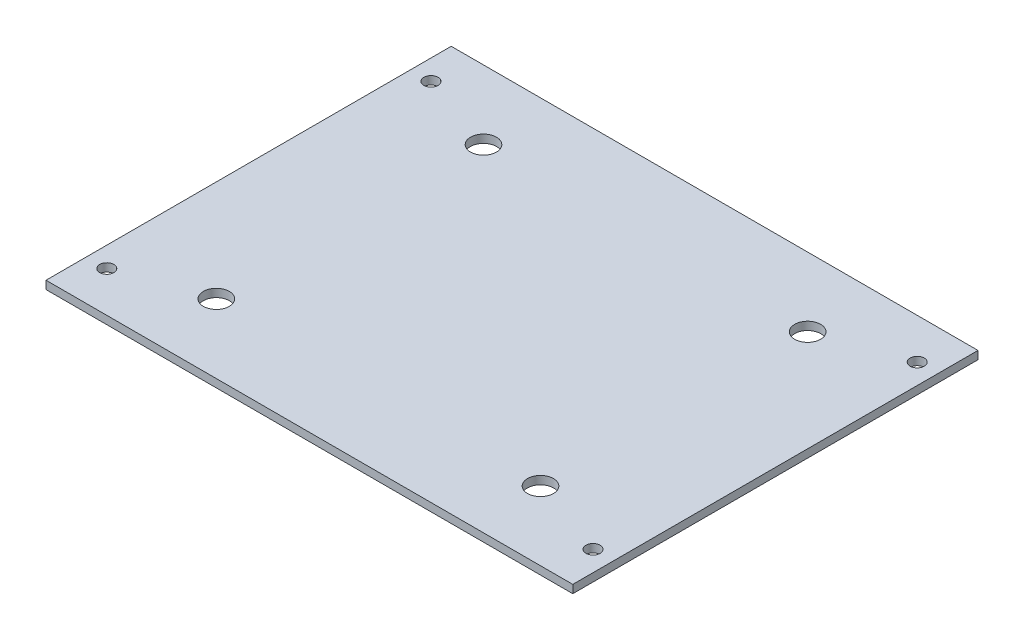
ISO-10303-21;
HEADER;
FILE_DESCRIPTION(('STEP AP214'),'2;1');
FILE_NAME('part.step','',(''),(''),'','','');
FILE_SCHEMA(('AUTOMOTIVE_DESIGN { 1 0 10303 214 1 1 1 1 }'));
ENDSEC;
DATA;
#1=APPLICATION_CONTEXT('core data for automotive mechanical design processes');
#2=APPLICATION_PROTOCOL_DEFINITION('international standard','automotive_design',2000,#1);
#3=PRODUCT_CONTEXT('',#1,'mechanical');
#4=PRODUCT('Part','Part','',(#3));
#5=PRODUCT_RELATED_PRODUCT_CATEGORY('part','',(#4));
#6=PRODUCT_DEFINITION_FORMATION('','',#4);
#7=PRODUCT_DEFINITION_CONTEXT('part definition',#1,'design');
#8=PRODUCT_DEFINITION('design','',#6,#7);
#9=PRODUCT_DEFINITION_SHAPE('','',#8);
#10=(LENGTH_UNIT() NAMED_UNIT(*) SI_UNIT(.MILLI.,.METRE.));
#11=(NAMED_UNIT(*) PLANE_ANGLE_UNIT() SI_UNIT($,.RADIAN.));
#12=(NAMED_UNIT(*) SI_UNIT($,.STERADIAN.) SOLID_ANGLE_UNIT());
#13=UNCERTAINTY_MEASURE_WITH_UNIT(LENGTH_MEASURE(1.E-05),#10,'distance_accuracy_value','');
#14=(GEOMETRIC_REPRESENTATION_CONTEXT(3) GLOBAL_UNCERTAINTY_ASSIGNED_CONTEXT((#13)) GLOBAL_UNIT_ASSIGNED_CONTEXT((#10,
#11,#12)) REPRESENTATION_CONTEXT('',''));
#15=CARTESIAN_POINT('',(0.,0.,0.));
#16=DIRECTION('',(0.,0.,1.));
#17=DIRECTION('',(1.,0.,0.));
#18=AXIS2_PLACEMENT_3D('',#15,#16,#17);
#19=CARTESIAN_POINT('',(0.,2.,0.));
#20=DIRECTION('',(0.,-1.,0.));
#21=DIRECTION('',(0.,0.,-1.));
#22=AXIS2_PLACEMENT_3D('',#19,#20,#21);
#23=PLANE('',#22);
#24=DIRECTION('',(0.,0.,1.));
#25=VECTOR('',#24,1.);
#26=CARTESIAN_POINT('',(0.,2.,0.));
#27=LINE('',#26,#25);
#28=CARTESIAN_POINT('',(0.,2.,-100.));
#29=VERTEX_POINT('',#28);
#30=CARTESIAN_POINT('',(0.,2.,0.));
#31=VERTEX_POINT('',#30);
#32=EDGE_CURVE('E84',#29,#31,#27,.T.);
#33=ORIENTED_EDGE('',*,*,#32,.T.);
#34=DIRECTION('',(1.,0.,0.));
#35=VECTOR('',#34,1.);
#36=CARTESIAN_POINT('',(0.,2.,0.));
#37=LINE('',#36,#35);
#38=CARTESIAN_POINT('',(130.,2.,0.));
#39=VERTEX_POINT('',#38);
#40=EDGE_CURVE('E79',#31,#39,#37,.T.);
#41=ORIENTED_EDGE('',*,*,#40,.T.);
#42=DIRECTION('',(0.,0.,-1.));
#43=VECTOR('',#42,1.);
#44=CARTESIAN_POINT('',(130.,2.,0.));
#45=LINE('',#44,#43);
#46=CARTESIAN_POINT('',(130.,2.,-100.));
#47=VERTEX_POINT('',#46);
#48=EDGE_CURVE('E82',#39,#47,#45,.T.);
#49=ORIENTED_EDGE('',*,*,#48,.T.);
#50=DIRECTION('',(-1.,0.,0.));
#51=VECTOR('',#50,1.);
#52=CARTESIAN_POINT('',(0.,2.,-100.));
#53=LINE('',#52,#51);
#54=EDGE_CURVE('E49',#47,#29,#53,.T.);
#55=ORIENTED_EDGE('',*,*,#54,.T.);
#56=EDGE_LOOP('',(#33,#41,#49,#55));
#57=FACE_BOUND('',#56,.T.);
#58=CARTESIAN_POINT('',(105.,1.99999999999945,-17.0342478014983));
#59=DIRECTION('',(0.,1.,0.));
#60=DIRECTION('',(0.,0.,1.));
#61=AXIS2_PLACEMENT_3D('',#58,#59,#60);
#62=CIRCLE('',#61,3.20000000000001);
#63=CARTESIAN_POINT('',(105.,1.99999999999945,-13.8342478014983));
#64=VERTEX_POINT('',#63);
#65=EDGE_CURVE('E99',#64,#64,#62,.T.);
#66=ORIENTED_EDGE('',*,*,#65,.F.);
#67=EDGE_LOOP('',(#66));
#68=FACE_BOUND('',#67,.T.);
#69=CARTESIAN_POINT('',(24.9999999999998,1.99999999999945,-17.0342478014983));
#70=DIRECTION('',(0.,1.,0.));
#71=DIRECTION('',(0.,0.,1.));
#72=AXIS2_PLACEMENT_3D('',#69,#70,#71);
#73=CIRCLE('',#72,3.19999999999999);
#74=CARTESIAN_POINT('',(24.9999999999998,1.99999999999945,-13.8342478014983));
#75=VERTEX_POINT('',#74);
#76=EDGE_CURVE('E114',#75,#75,#73,.T.);
#77=ORIENTED_EDGE('',*,*,#76,.F.);
#78=EDGE_LOOP('',(#77));
#79=FACE_BOUND('',#78,.T.);
#80=CARTESIAN_POINT('',(105.,1.99999999999942,-82.9657521985017));
#81=DIRECTION('',(0.,1.,0.));
#82=DIRECTION('',(0.,0.,-1.));
#83=AXIS2_PLACEMENT_3D('',#80,#81,#82);
#84=CIRCLE('',#83,3.20000000000001);
#85=CARTESIAN_POINT('',(105.,1.99999999999942,-86.1657521985017));
#86=VERTEX_POINT('',#85);
#87=EDGE_CURVE('E120',#86,#86,#84,.T.);
#88=ORIENTED_EDGE('',*,*,#87,.F.);
#89=EDGE_LOOP('',(#88));
#90=FACE_BOUND('',#89,.T.);
#91=CARTESIAN_POINT('',(24.9999999999998,1.99999999999942,-82.9657521985017));
#92=DIRECTION('',(0.,1.,0.));
#93=DIRECTION('',(0.,0.,-1.));
#94=AXIS2_PLACEMENT_3D('',#91,#92,#93);
#95=CIRCLE('',#94,3.19999999999999);
#96=CARTESIAN_POINT('',(24.9999999999998,1.99999999999942,-86.1657521985017));
#97=VERTEX_POINT('',#96);
#98=EDGE_CURVE('E126',#97,#97,#95,.T.);
#99=ORIENTED_EDGE('',*,*,#98,.F.);
#100=EDGE_LOOP('',(#99));
#101=FACE_BOUND('',#100,.T.);
#102=CARTESIAN_POINT('',(5.,1.99999999999945,-90.));
#103=DIRECTION('',(0.,1.,0.));
#104=DIRECTION('',(0.,0.,1.));
#105=AXIS2_PLACEMENT_3D('',#102,#103,#104);
#106=CIRCLE('',#105,1.75);
#107=CARTESIAN_POINT('',(5.,1.99999999999945,-88.25));
#108=VERTEX_POINT('',#107);
#109=EDGE_CURVE('E132',#108,#108,#106,.T.);
#110=ORIENTED_EDGE('',*,*,#109,.F.);
#111=EDGE_LOOP('',(#110));
#112=FACE_BOUND('',#111,.T.);
#113=CARTESIAN_POINT('',(5.,1.99999999999945,-9.99999999999999));
#114=DIRECTION('',(0.,1.,0.));
#115=DIRECTION('',(0.,0.,-1.));
#116=AXIS2_PLACEMENT_3D('',#113,#114,#115);
#117=CIRCLE('',#116,1.75);
#118=CARTESIAN_POINT('',(5.,1.99999999999945,-11.75));
#119=VERTEX_POINT('',#118);
#120=EDGE_CURVE('E138',#119,#119,#117,.T.);
#121=ORIENTED_EDGE('',*,*,#120,.F.);
#122=EDGE_LOOP('',(#121));
#123=FACE_BOUND('',#122,.T.);
#124=CARTESIAN_POINT('',(125.,1.99999999999945,-10.));
#125=DIRECTION('',(0.,1.,0.));
#126=DIRECTION('',(0.,0.,1.));
#127=AXIS2_PLACEMENT_3D('',#124,#125,#126);
#128=CIRCLE('',#127,1.75);
#129=CARTESIAN_POINT('',(125.,1.99999999999945,-8.25000000000005));
#130=VERTEX_POINT('',#129);
#131=EDGE_CURVE('E144',#130,#130,#128,.T.);
#132=ORIENTED_EDGE('',*,*,#131,.F.);
#133=EDGE_LOOP('',(#132));
#134=FACE_BOUND('',#133,.T.);
#135=CARTESIAN_POINT('',(125.,1.99999999999945,-90.));
#136=DIRECTION('',(0.,1.,0.));
#137=DIRECTION('',(0.,0.,-1.));
#138=AXIS2_PLACEMENT_3D('',#135,#136,#137);
#139=CIRCLE('',#138,1.75);
#140=CARTESIAN_POINT('',(125.,1.99999999999945,-91.75));
#141=VERTEX_POINT('',#140);
#142=EDGE_CURVE('E150',#141,#141,#139,.T.);
#143=ORIENTED_EDGE('',*,*,#142,.F.);
#144=EDGE_LOOP('',(#143));
#145=FACE_BOUND('',#144,.T.);
#146=ADVANCED_FACE('F32',(#57,#68,#79,#90,#101,#112,#123,#134,#145),#23,.F.);
#147=CARTESIAN_POINT('',(0.,0.,0.));
#148=DIRECTION('',(0.,-1.,0.));
#149=DIRECTION('',(0.,0.,-1.));
#150=AXIS2_PLACEMENT_3D('',#147,#148,#149);
#151=PLANE('',#150);
#152=CARTESIAN_POINT('',(125.,-5.55111512312578E-13,-10.));
#153=DIRECTION('',(0.,1.,0.));
#154=DIRECTION('',(0.,0.,1.));
#155=AXIS2_PLACEMENT_3D('',#152,#153,#154);
#156=CIRCLE('',#155,1.75);
#157=CARTESIAN_POINT('',(125.,-5.55111512312578E-13,-8.25000000000005));
#158=VERTEX_POINT('',#157);
#159=EDGE_CURVE('E147',#158,#158,#156,.T.);
#160=ORIENTED_EDGE('',*,*,#159,.T.);
#161=EDGE_LOOP('',(#160));
#162=FACE_BOUND('',#161,.T.);
#163=CARTESIAN_POINT('',(5.,-5.55111512312578E-13,-90.));
#164=DIRECTION('',(0.,1.,0.));
#165=DIRECTION('',(0.,0.,1.));
#166=AXIS2_PLACEMENT_3D('',#163,#164,#165);
#167=CIRCLE('',#166,1.75);
#168=CARTESIAN_POINT('',(5.,-5.55111512312578E-13,-88.25));
#169=VERTEX_POINT('',#168);
#170=EDGE_CURVE('E135',#169,#169,#167,.T.);
#171=ORIENTED_EDGE('',*,*,#170,.T.);
#172=EDGE_LOOP('',(#171));
#173=FACE_BOUND('',#172,.T.);
#174=CARTESIAN_POINT('',(105.,-5.55111512312578E-13,-82.9657521985017));
#175=DIRECTION('',(0.,1.,0.));
#176=DIRECTION('',(0.,0.,-1.));
#177=AXIS2_PLACEMENT_3D('',#174,#175,#176);
#178=CIRCLE('',#177,3.20000000000001);
#179=CARTESIAN_POINT('',(105.,-5.55111512312578E-13,-86.1657521985017));
#180=VERTEX_POINT('',#179);
#181=EDGE_CURVE('E123',#180,#180,#178,.T.);
#182=ORIENTED_EDGE('',*,*,#181,.T.);
#183=EDGE_LOOP('',(#182));
#184=FACE_BOUND('',#183,.T.);
#185=CARTESIAN_POINT('',(105.,-5.55111512312578E-13,-17.0342478014983));
#186=DIRECTION('',(0.,1.,0.));
#187=DIRECTION('',(0.,0.,1.));
#188=AXIS2_PLACEMENT_3D('',#185,#186,#187);
#189=CIRCLE('',#188,3.20000000000001);
#190=CARTESIAN_POINT('',(105.,-5.55111512312578E-13,-13.8342478014983));
#191=VERTEX_POINT('',#190);
#192=EDGE_CURVE('E111',#191,#191,#189,.T.);
#193=ORIENTED_EDGE('',*,*,#192,.T.);
#194=EDGE_LOOP('',(#193));
#195=FACE_BOUND('',#194,.T.);
#196=DIRECTION('',(0.,0.,1.));
#197=VECTOR('',#196,1.);
#198=CARTESIAN_POINT('',(0.,0.,0.));
#199=LINE('',#198,#197);
#200=CARTESIAN_POINT('',(0.,0.,-100.));
#201=VERTEX_POINT('',#200);
#202=CARTESIAN_POINT('',(0.,0.,0.));
#203=VERTEX_POINT('',#202);
#204=EDGE_CURVE('E96',#201,#203,#199,.T.);
#205=ORIENTED_EDGE('',*,*,#204,.F.);
#206=DIRECTION('',(-1.,0.,0.));
#207=VECTOR('',#206,1.);
#208=CARTESIAN_POINT('',(0.,0.,-100.));
#209=LINE('',#208,#207);
#210=CARTESIAN_POINT('',(130.,0.,-100.));
#211=VERTEX_POINT('',#210);
#212=EDGE_CURVE('E72',#211,#201,#209,.T.);
#213=ORIENTED_EDGE('',*,*,#212,.F.);
#214=DIRECTION('',(0.,0.,-1.));
#215=VECTOR('',#214,1.);
#216=CARTESIAN_POINT('',(130.,0.,0.));
#217=LINE('',#216,#215);
#218=CARTESIAN_POINT('',(130.,0.,0.));
#219=VERTEX_POINT('',#218);
#220=EDGE_CURVE('E66',#219,#211,#217,.T.);
#221=ORIENTED_EDGE('',*,*,#220,.F.);
#222=DIRECTION('',(1.,0.,0.));
#223=VECTOR('',#222,1.);
#224=CARTESIAN_POINT('',(0.,0.,0.));
#225=LINE('',#224,#223);
#226=EDGE_CURVE('E88',#203,#219,#225,.T.);
#227=ORIENTED_EDGE('',*,*,#226,.F.);
#228=EDGE_LOOP('',(#205,#213,#221,#227));
#229=FACE_BOUND('',#228,.T.);
#230=CARTESIAN_POINT('',(24.9999999999998,-5.55111512312578E-13,-17.0342478014983));
#231=DIRECTION('',(0.,1.,0.));
#232=DIRECTION('',(0.,0.,1.));
#233=AXIS2_PLACEMENT_3D('',#230,#231,#232);
#234=CIRCLE('',#233,3.19999999999999);
#235=CARTESIAN_POINT('',(24.9999999999998,-5.55111512312578E-13,-13.8342478014983));
#236=VERTEX_POINT('',#235);
#237=EDGE_CURVE('E117',#236,#236,#234,.T.);
#238=ORIENTED_EDGE('',*,*,#237,.T.);
#239=EDGE_LOOP('',(#238));
#240=FACE_BOUND('',#239,.T.);
#241=CARTESIAN_POINT('',(24.9999999999998,-5.55111512312578E-13,-82.9657521985017));
#242=DIRECTION('',(0.,1.,0.));
#243=DIRECTION('',(0.,0.,-1.));
#244=AXIS2_PLACEMENT_3D('',#241,#242,#243);
#245=CIRCLE('',#244,3.19999999999999);
#246=CARTESIAN_POINT('',(24.9999999999998,-5.55111512312578E-13,-86.1657521985017));
#247=VERTEX_POINT('',#246);
#248=EDGE_CURVE('E129',#247,#247,#245,.T.);
#249=ORIENTED_EDGE('',*,*,#248,.T.);
#250=EDGE_LOOP('',(#249));
#251=FACE_BOUND('',#250,.T.);
#252=CARTESIAN_POINT('',(5.,-5.55111512312578E-13,-9.99999999999999));
#253=DIRECTION('',(0.,1.,0.));
#254=DIRECTION('',(0.,0.,-1.));
#255=AXIS2_PLACEMENT_3D('',#252,#253,#254);
#256=CIRCLE('',#255,1.75);
#257=CARTESIAN_POINT('',(5.,-5.55111512312578E-13,-11.75));
#258=VERTEX_POINT('',#257);
#259=EDGE_CURVE('E141',#258,#258,#256,.T.);
#260=ORIENTED_EDGE('',*,*,#259,.T.);
#261=EDGE_LOOP('',(#260));
#262=FACE_BOUND('',#261,.T.);
#263=CARTESIAN_POINT('',(125.,-5.55111512312578E-13,-90.));
#264=DIRECTION('',(0.,1.,0.));
#265=DIRECTION('',(0.,0.,-1.));
#266=AXIS2_PLACEMENT_3D('',#263,#264,#265);
#267=CIRCLE('',#266,1.75);
#268=CARTESIAN_POINT('',(125.,-5.55111512312578E-13,-91.75));
#269=VERTEX_POINT('',#268);
#270=EDGE_CURVE('E153',#269,#269,#267,.T.);
#271=ORIENTED_EDGE('',*,*,#270,.T.);
#272=EDGE_LOOP('',(#271));
#273=FACE_BOUND('',#272,.T.);
#274=ADVANCED_FACE('F107',(#162,#173,#184,#195,#229,#240,#251,#262,#273),#151,.T.);
#275=CARTESIAN_POINT('',(0.,2.,0.));
#276=DIRECTION('',(1.,0.,0.));
#277=DIRECTION('',(0.,0.,-1.));
#278=AXIS2_PLACEMENT_3D('',#275,#276,#277);
#279=PLANE('',#278);
#280=ORIENTED_EDGE('',*,*,#204,.T.);
#281=DIRECTION('',(0.,-1.,0.));
#282=VECTOR('',#281,1.);
#283=CARTESIAN_POINT('',(0.,2.,0.));
#284=LINE('',#283,#282);
#285=EDGE_CURVE('E11',#31,#203,#284,.T.);
#286=ORIENTED_EDGE('',*,*,#285,.F.);
#287=ORIENTED_EDGE('',*,*,#32,.F.);
#288=DIRECTION('',(0.,-1.,0.));
#289=VECTOR('',#288,1.);
#290=CARTESIAN_POINT('',(0.,2.,-100.));
#291=LINE('',#290,#289);
#292=EDGE_CURVE('E92',#29,#201,#291,.T.);
#293=ORIENTED_EDGE('',*,*,#292,.T.);
#294=EDGE_LOOP('',(#280,#286,#287,#293));
#295=FACE_BOUND('',#294,.T.);
#296=ADVANCED_FACE('F34',(#295),#279,.F.);
#297=CARTESIAN_POINT('',(0.,2.,0.));
#298=DIRECTION('',(0.,0.,-1.));
#299=DIRECTION('',(-1.,0.,0.));
#300=AXIS2_PLACEMENT_3D('',#297,#298,#299);
#301=PLANE('',#300);
#302=ORIENTED_EDGE('',*,*,#226,.T.);
#303=DIRECTION('',(0.,-1.,0.));
#304=VECTOR('',#303,1.);
#305=CARTESIAN_POINT('',(130.,2.,0.));
#306=LINE('',#305,#304);
#307=EDGE_CURVE('E41',#39,#219,#306,.T.);
#308=ORIENTED_EDGE('',*,*,#307,.F.);
#309=ORIENTED_EDGE('',*,*,#40,.F.);
#310=ORIENTED_EDGE('',*,*,#285,.T.);
#311=EDGE_LOOP('',(#302,#308,#309,#310));
#312=FACE_BOUND('',#311,.T.);
#313=ADVANCED_FACE('F87',(#312),#301,.F.);
#314=CARTESIAN_POINT('',(130.,2.,0.));
#315=DIRECTION('',(-1.,0.,0.));
#316=DIRECTION('',(0.,0.,1.));
#317=AXIS2_PLACEMENT_3D('',#314,#315,#316);
#318=PLANE('',#317);
#319=ORIENTED_EDGE('',*,*,#220,.T.);
#320=DIRECTION('',(0.,-1.,0.));
#321=VECTOR('',#320,1.);
#322=CARTESIAN_POINT('',(130.,2.,-100.));
#323=LINE('',#322,#321);
#324=EDGE_CURVE('E89',#47,#211,#323,.T.);
#325=ORIENTED_EDGE('',*,*,#324,.F.);
#326=ORIENTED_EDGE('',*,*,#48,.F.);
#327=ORIENTED_EDGE('',*,*,#307,.T.);
#328=EDGE_LOOP('',(#319,#325,#326,#327));
#329=FACE_BOUND('',#328,.T.);
#330=ADVANCED_FACE('F90',(#329),#318,.F.);
#331=CARTESIAN_POINT('',(0.,2.,-100.));
#332=DIRECTION('',(0.,0.,1.));
#333=DIRECTION('',(1.,0.,0.));
#334=AXIS2_PLACEMENT_3D('',#331,#332,#333);
#335=PLANE('',#334);
#336=ORIENTED_EDGE('',*,*,#212,.T.);
#337=ORIENTED_EDGE('',*,*,#292,.F.);
#338=ORIENTED_EDGE('',*,*,#54,.F.);
#339=ORIENTED_EDGE('',*,*,#324,.T.);
#340=EDGE_LOOP('',(#336,#337,#338,#339));
#341=FACE_BOUND('',#340,.T.);
#342=ADVANCED_FACE('F104',(#341),#335,.F.);
#343=CARTESIAN_POINT('',(105.,1.99999999999945,-17.0342478014983));
#344=DIRECTION('',(0.,-1.,0.));
#345=DIRECTION('',(0.,0.,-1.));
#346=AXIS2_PLACEMENT_3D('',#343,#344,#345);
#347=CYLINDRICAL_SURFACE('',#346,3.20000000000001);
#348=ORIENTED_EDGE('',*,*,#65,.T.);
#349=EDGE_LOOP('',(#348));
#350=FACE_BOUND('',#349,.T.);
#351=ORIENTED_EDGE('',*,*,#192,.F.);
#352=EDGE_LOOP('',(#351));
#353=FACE_BOUND('',#352,.T.);
#354=ADVANCED_FACE('F170',(#350,#353),#347,.F.);
#355=CARTESIAN_POINT('',(24.9999999999998,1.99999999999945,-17.0342478014983));
#356=DIRECTION('',(0.,-1.,0.));
#357=DIRECTION('',(0.,0.,-1.));
#358=AXIS2_PLACEMENT_3D('',#355,#356,#357);
#359=CYLINDRICAL_SURFACE('',#358,3.19999999999999);
#360=ORIENTED_EDGE('',*,*,#76,.T.);
#361=EDGE_LOOP('',(#360));
#362=FACE_BOUND('',#361,.T.);
#363=ORIENTED_EDGE('',*,*,#237,.F.);
#364=EDGE_LOOP('',(#363));
#365=FACE_BOUND('',#364,.T.);
#366=ADVANCED_FACE('F216',(#362,#365),#359,.F.);
#367=CARTESIAN_POINT('',(105.,1.99999999999942,-82.9657521985017));
#368=DIRECTION('',(0.,-1.,0.));
#369=DIRECTION('',(0.,0.,-1.));
#370=AXIS2_PLACEMENT_3D('',#367,#368,#369);
#371=CYLINDRICAL_SURFACE('',#370,3.20000000000001);
#372=ORIENTED_EDGE('',*,*,#87,.T.);
#373=EDGE_LOOP('',(#372));
#374=FACE_BOUND('',#373,.T.);
#375=ORIENTED_EDGE('',*,*,#181,.F.);
#376=EDGE_LOOP('',(#375));
#377=FACE_BOUND('',#376,.T.);
#378=ADVANCED_FACE('F224',(#374,#377),#371,.F.);
#379=CARTESIAN_POINT('',(24.9999999999998,1.99999999999942,-82.9657521985017));
#380=DIRECTION('',(0.,-1.,0.));
#381=DIRECTION('',(0.,0.,-1.));
#382=AXIS2_PLACEMENT_3D('',#379,#380,#381);
#383=CYLINDRICAL_SURFACE('',#382,3.19999999999999);
#384=ORIENTED_EDGE('',*,*,#98,.T.);
#385=EDGE_LOOP('',(#384));
#386=FACE_BOUND('',#385,.T.);
#387=ORIENTED_EDGE('',*,*,#248,.F.);
#388=EDGE_LOOP('',(#387));
#389=FACE_BOUND('',#388,.T.);
#390=ADVANCED_FACE('F232',(#386,#389),#383,.F.);
#391=CARTESIAN_POINT('',(5.,1.99999999999945,-90.));
#392=DIRECTION('',(0.,-1.,0.));
#393=DIRECTION('',(0.,0.,-1.));
#394=AXIS2_PLACEMENT_3D('',#391,#392,#393);
#395=CYLINDRICAL_SURFACE('',#394,1.75);
#396=ORIENTED_EDGE('',*,*,#109,.T.);
#397=EDGE_LOOP('',(#396));
#398=FACE_BOUND('',#397,.T.);
#399=ORIENTED_EDGE('',*,*,#170,.F.);
#400=EDGE_LOOP('',(#399));
#401=FACE_BOUND('',#400,.T.);
#402=ADVANCED_FACE('F241',(#398,#401),#395,.F.);
#403=CARTESIAN_POINT('',(5.,1.99999999999945,-9.99999999999999));
#404=DIRECTION('',(0.,-1.,0.));
#405=DIRECTION('',(0.,0.,-1.));
#406=AXIS2_PLACEMENT_3D('',#403,#404,#405);
#407=CYLINDRICAL_SURFACE('',#406,1.75);
#408=ORIENTED_EDGE('',*,*,#120,.T.);
#409=EDGE_LOOP('',(#408));
#410=FACE_BOUND('',#409,.T.);
#411=ORIENTED_EDGE('',*,*,#259,.F.);
#412=EDGE_LOOP('',(#411));
#413=FACE_BOUND('',#412,.T.);
#414=ADVANCED_FACE('F250',(#410,#413),#407,.F.);
#415=CARTESIAN_POINT('',(125.,1.99999999999945,-10.));
#416=DIRECTION('',(0.,-1.,0.));
#417=DIRECTION('',(0.,0.,-1.));
#418=AXIS2_PLACEMENT_3D('',#415,#416,#417);
#419=CYLINDRICAL_SURFACE('',#418,1.75);
#420=ORIENTED_EDGE('',*,*,#131,.T.);
#421=EDGE_LOOP('',(#420));
#422=FACE_BOUND('',#421,.T.);
#423=ORIENTED_EDGE('',*,*,#159,.F.);
#424=EDGE_LOOP('',(#423));
#425=FACE_BOUND('',#424,.T.);
#426=ADVANCED_FACE('F259',(#422,#425),#419,.F.);
#427=CARTESIAN_POINT('',(125.,1.99999999999945,-90.));
#428=DIRECTION('',(0.,-1.,0.));
#429=DIRECTION('',(0.,0.,-1.));
#430=AXIS2_PLACEMENT_3D('',#427,#428,#429);
#431=CYLINDRICAL_SURFACE('',#430,1.75);
#432=ORIENTED_EDGE('',*,*,#142,.T.);
#433=EDGE_LOOP('',(#432));
#434=FACE_BOUND('',#433,.T.);
#435=ORIENTED_EDGE('',*,*,#270,.F.);
#436=EDGE_LOOP('',(#435));
#437=FACE_BOUND('',#436,.T.);
#438=ADVANCED_FACE('F159',(#434,#437),#431,.F.);
#439=CLOSED_SHELL('',(#146,#274,#296,#313,#330,#342,#354,#366,#378,#390,#402,#414,#426,#438));
#440=MANIFOLD_SOLID_BREP('B2',#439);
#441=ADVANCED_BREP_SHAPE_REPRESENTATION('',(#18,#440),#14);
#442=SHAPE_DEFINITION_REPRESENTATION(#9,#441);
ENDSEC;
END-ISO-10303-21;
